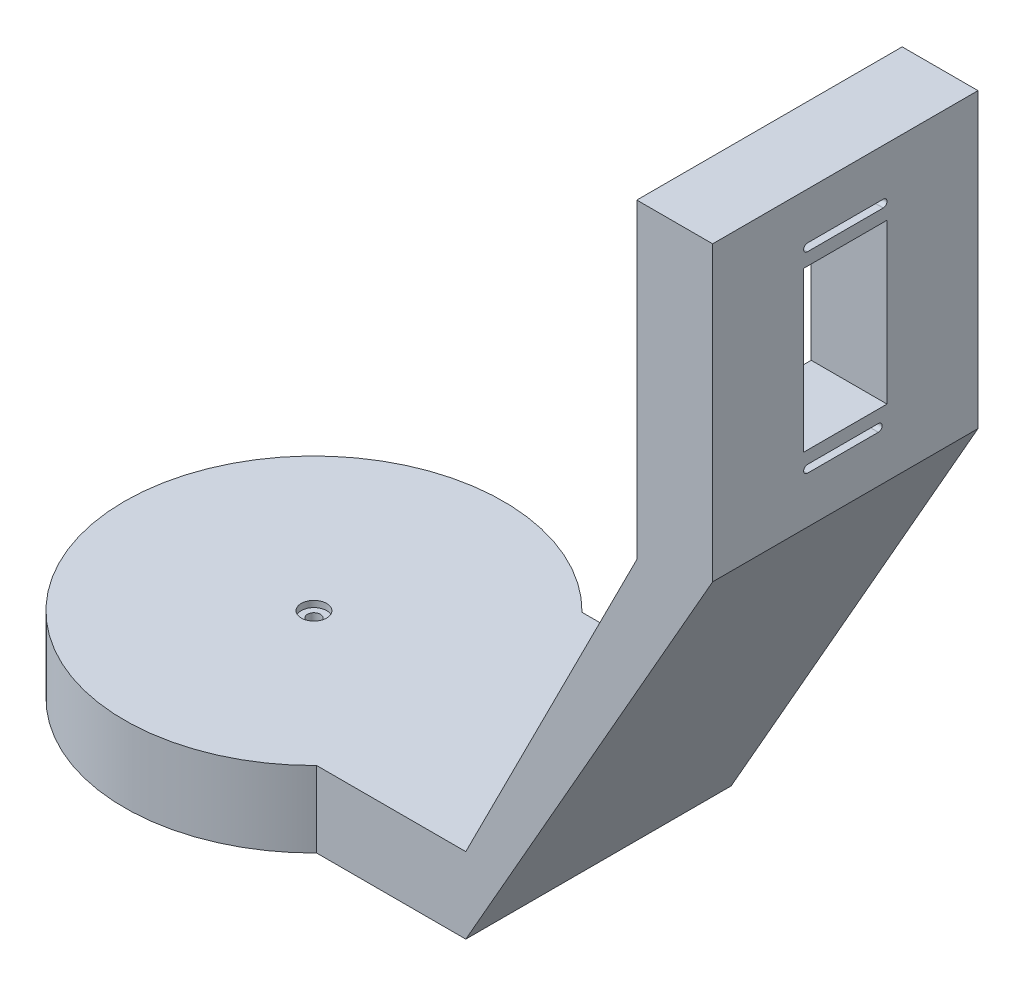
ISO-10303-21;
HEADER;
FILE_DESCRIPTION(('STEP AP214'),'2;1');
FILE_NAME('part.step','',(''),(''),'','','');
FILE_SCHEMA(('AUTOMOTIVE_DESIGN { 1 0 10303 214 1 1 1 1 }'));
ENDSEC;
DATA;
#1=APPLICATION_CONTEXT('core data for automotive mechanical design processes');
#2=APPLICATION_PROTOCOL_DEFINITION('international standard','automotive_design',2000,#1);
#3=PRODUCT_CONTEXT('',#1,'mechanical');
#4=PRODUCT('Part','Part','',(#3));
#5=PRODUCT_RELATED_PRODUCT_CATEGORY('part','',(#4));
#6=PRODUCT_DEFINITION_FORMATION('','',#4);
#7=PRODUCT_DEFINITION_CONTEXT('part definition',#1,'design');
#8=PRODUCT_DEFINITION('design','',#6,#7);
#9=PRODUCT_DEFINITION_SHAPE('','',#8);
#10=(LENGTH_UNIT() NAMED_UNIT(*) SI_UNIT(.MILLI.,.METRE.));
#11=(NAMED_UNIT(*) PLANE_ANGLE_UNIT() SI_UNIT($,.RADIAN.));
#12=(NAMED_UNIT(*) SI_UNIT($,.STERADIAN.) SOLID_ANGLE_UNIT());
#13=UNCERTAINTY_MEASURE_WITH_UNIT(LENGTH_MEASURE(1.E-05),#10,'distance_accuracy_value','');
#14=(GEOMETRIC_REPRESENTATION_CONTEXT(3) GLOBAL_UNCERTAINTY_ASSIGNED_CONTEXT((#13)) GLOBAL_UNIT_ASSIGNED_CONTEXT((#10,
#11,#12)) REPRESENTATION_CONTEXT('',''));
#15=CARTESIAN_POINT('',(0.,0.,0.));
#16=DIRECTION('',(0.,0.,1.));
#17=DIRECTION('',(1.,0.,0.));
#18=AXIS2_PLACEMENT_3D('',#15,#16,#17);
#19=CARTESIAN_POINT('',(0.,20.,0.));
#20=DIRECTION('',(0.,1.,0.));
#21=DIRECTION('',(0.,0.,1.));
#22=AXIS2_PLACEMENT_3D('',#19,#20,#21);
#23=CYLINDRICAL_SURFACE('',#22,1.7);
#24=CARTESIAN_POINT('',(0.,18.35,0.));
#25=DIRECTION('',(0.,1.,0.));
#26=DIRECTION('',(0.,0.,1.));
#27=AXIS2_PLACEMENT_3D('',#24,#25,#26);
#28=CIRCLE('',#27,1.7);
#29=CARTESIAN_POINT('',(0.,18.35,1.7));
#30=VERTEX_POINT('',#29);
#31=EDGE_CURVE('E448',#30,#30,#28,.T.);
#32=ORIENTED_EDGE('',*,*,#31,.T.);
#33=EDGE_LOOP('',(#32));
#34=FACE_BOUND('',#33,.T.);
#35=CARTESIAN_POINT('',(0.,3.5,0.));
#36=DIRECTION('',(0.,-1.,0.));
#37=DIRECTION('',(0.,0.,-1.));
#38=AXIS2_PLACEMENT_3D('',#35,#36,#37);
#39=CIRCLE('',#38,1.7);
#40=CARTESIAN_POINT('',(0.,3.5,-1.7));
#41=VERTEX_POINT('',#40);
#42=EDGE_CURVE('E45',#41,#41,#39,.F.);
#43=ORIENTED_EDGE('',*,*,#42,.F.);
#44=EDGE_LOOP('',(#43));
#45=FACE_BOUND('',#44,.T.);
#46=ADVANCED_FACE('F41',(#34,#45),#23,.F.);
#47=CARTESIAN_POINT('',(30.,2.,-0.0220346998523853));
#48=DIRECTION('',(0.,-1.,0.));
#49=DIRECTION('',(0.,0.,-1.));
#50=AXIS2_PLACEMENT_3D('',#47,#48,#49);
#51=PLANE('',#50);
#52=DIRECTION('',(0.,0.,1.));
#53=VECTOR('',#52,1.);
#54=CARTESIAN_POINT('',(10.446834113617,2.,-0.0220346998523853));
#55=LINE('',#54,#53);
#56=CARTESIAN_POINT('',(10.446834113617,2.,-4.95844978584569));
#57=VERTEX_POINT('',#56);
#58=CARTESIAN_POINT('',(10.446834113617,2.,4.94470051522393));
#59=VERTEX_POINT('',#58);
#60=EDGE_CURVE('E289',#57,#59,#55,.T.);
#61=ORIENTED_EDGE('',*,*,#60,.F.);
#62=DIRECTION('',(-0.995066694728679,0.,-0.0992082307157115));
#63=VECTOR('',#62,1.);
#64=CARTESIAN_POINT('',(29.889613094827,2.,-3.02000313383669));
#65=LINE('',#64,#63);
#66=CARTESIAN_POINT('',(29.889613094827,2.,-3.02000313383669));
#67=VERTEX_POINT('',#66);
#68=EDGE_CURVE('E323',#67,#57,#65,.T.);
#69=ORIENTED_EDGE('',*,*,#68,.F.);
#70=CARTESIAN_POINT('',(30.,2.,-0.0220346998523853));
#71=DIRECTION('',(0.,-1.,0.));
#72=DIRECTION('',(0.,0.,-1.));
#73=AXIS2_PLACEMENT_3D('',#70,#71,#72);
#74=CIRCLE('',#73,3.);
#75=CARTESIAN_POINT('',(29.9254967375497,2.,2.97704003477566));
#76=VERTEX_POINT('',#75);
#77=EDGE_CURVE('E304',#67,#76,#74,.T.);
#78=ORIENTED_EDGE('',*,*,#77,.T.);
#79=DIRECTION('',(-0.994936582249236,0.,0.100504712835816));
#80=VECTOR('',#79,1.);
#81=CARTESIAN_POINT('',(29.9254967375497,2.,2.97704003477566));
#82=LINE('',#81,#80);
#83=EDGE_CURVE('E308',#76,#59,#82,.T.);
#84=ORIENTED_EDGE('',*,*,#83,.T.);
#85=EDGE_LOOP('',(#61,#69,#78,#84));
#86=FACE_BOUND('',#85,.T.);
#87=ADVANCED_FACE('F648',(#86),#51,.T.);
#88=CARTESIAN_POINT('',(0.,20.,0.));
#89=DIRECTION('',(0.,-1.,0.));
#90=DIRECTION('',(0.,0.,-1.));
#91=AXIS2_PLACEMENT_3D('',#88,#89,#90);
#92=CYLINDRICAL_SURFACE('',#91,50.);
#93=CARTESIAN_POINT('',(0.,0.,0.));
#94=DIRECTION('',(0.,1.,0.));
#95=DIRECTION('',(0.,0.,1.));
#96=AXIS2_PLACEMENT_3D('',#93,#94,#95);
#97=CIRCLE('',#96,50.);
#98=CARTESIAN_POINT('',(35.7071421427143,0.,-35.));
#99=VERTEX_POINT('',#98);
#100=CARTESIAN_POINT('',(35.7071421427143,0.,35.));
#101=VERTEX_POINT('',#100);
#102=EDGE_CURVE('E496',#99,#101,#97,.T.);
#103=ORIENTED_EDGE('',*,*,#102,.T.);
#104=DIRECTION('',(0.,-1.,0.));
#105=VECTOR('',#104,1.);
#106=CARTESIAN_POINT('',(35.7071421427143,20.,35.));
#107=LINE('',#106,#105);
#108=CARTESIAN_POINT('',(35.7071421427143,20.,35.));
#109=VERTEX_POINT('',#108);
#110=EDGE_CURVE('E536',#109,#101,#107,.T.);
#111=ORIENTED_EDGE('',*,*,#110,.F.);
#112=CARTESIAN_POINT('',(0.,20.,0.));
#113=DIRECTION('',(0.,1.,0.));
#114=DIRECTION('',(0.,0.,1.));
#115=AXIS2_PLACEMENT_3D('',#112,#113,#114);
#116=CIRCLE('',#115,50.);
#117=CARTESIAN_POINT('',(35.7071421427143,20.,-35.));
#118=VERTEX_POINT('',#117);
#119=EDGE_CURVE('E505',#118,#109,#116,.T.);
#120=ORIENTED_EDGE('',*,*,#119,.F.);
#121=DIRECTION('',(0.,-1.,0.));
#122=VECTOR('',#121,1.);
#123=CARTESIAN_POINT('',(35.7071421427143,20.,-35.));
#124=LINE('',#123,#122);
#125=EDGE_CURVE('E521',#118,#99,#124,.T.);
#126=ORIENTED_EDGE('',*,*,#125,.T.);
#127=EDGE_LOOP('',(#103,#111,#120,#126));
#128=FACE_BOUND('',#127,.T.);
#129=ADVANCED_FACE('F43',(#128),#92,.T.);
#130=CARTESIAN_POINT('',(0.,20.,35.));
#131=DIRECTION('',(0.,0.,-1.));
#132=DIRECTION('',(-1.,0.,0.));
#133=AXIS2_PLACEMENT_3D('',#130,#131,#132);
#134=PLANE('',#133);
#135=DIRECTION('',(1.,0.,0.));
#136=VECTOR('',#135,1.);
#137=CARTESIAN_POINT('',(0.,0.,35.));
#138=LINE('',#137,#136);
#139=CARTESIAN_POINT('',(75.0554768047186,0.,35.));
#140=VERTEX_POINT('',#139);
#141=EDGE_CURVE('E525',#101,#140,#138,.T.);
#142=ORIENTED_EDGE('',*,*,#141,.T.);
#143=DIRECTION('',(0.495370386359118,0.868681863698338,0.));
#144=VECTOR('',#143,1.);
#145=CARTESIAN_POINT('',(75.0554768047186,0.,35.));
#146=LINE('',#145,#144);
#147=CARTESIAN_POINT('',(140.174133176639,114.192122372215,35.));
#148=VERTEX_POINT('',#147);
#149=EDGE_CURVE('E458',#140,#148,#146,.T.);
#150=ORIENTED_EDGE('',*,*,#149,.T.);
#151=DIRECTION('',(0.,1.,0.));
#152=VECTOR('',#151,1.);
#153=CARTESIAN_POINT('',(140.174133176639,114.192122372215,35.));
#154=LINE('',#153,#152);
#155=CARTESIAN_POINT('',(140.174133176639,191.411564080646,35.));
#156=VERTEX_POINT('',#155);
#157=EDGE_CURVE('E452',#148,#156,#154,.T.);
#158=ORIENTED_EDGE('',*,*,#157,.T.);
#159=DIRECTION('',(-1.,0.,0.));
#160=VECTOR('',#159,1.);
#161=CARTESIAN_POINT('',(140.174133176639,191.411564080646,35.));
#162=LINE('',#161,#160);
#163=CARTESIAN_POINT('',(120.174133176639,191.411564080646,35.));
#164=VERTEX_POINT('',#163);
#165=EDGE_CURVE('E478',#156,#164,#162,.T.);
#166=ORIENTED_EDGE('',*,*,#165,.T.);
#167=DIRECTION('',(0.,-1.,0.));
#168=VECTOR('',#167,1.);
#169=CARTESIAN_POINT('',(120.174133176639,191.411564080646,35.));
#170=LINE('',#169,#168);
#171=CARTESIAN_POINT('',(120.174133176639,109.286292207177,35.));
#172=VERTEX_POINT('',#171);
#173=EDGE_CURVE('E482',#164,#172,#170,.T.);
#174=ORIENTED_EDGE('',*,*,#173,.T.);
#175=DIRECTION('',(-0.451012165575392,-0.892517801784925,0.));
#176=VECTOR('',#175,1.);
#177=CARTESIAN_POINT('',(120.174133176639,109.286292207177,35.));
#178=LINE('',#177,#176);
#179=CARTESIAN_POINT('',(75.0554768047186,20.,35.));
#180=VERTEX_POINT('',#179);
#181=EDGE_CURVE('E486',#172,#180,#178,.T.);
#182=ORIENTED_EDGE('',*,*,#181,.T.);
#183=DIRECTION('',(1.,0.,0.));
#184=VECTOR('',#183,1.);
#185=CARTESIAN_POINT('',(0.,20.,35.));
#186=LINE('',#185,#184);
#187=EDGE_CURVE('E509',#109,#180,#186,.T.);
#188=ORIENTED_EDGE('',*,*,#187,.F.);
#189=ORIENTED_EDGE('',*,*,#110,.T.);
#190=EDGE_LOOP('',(#142,#150,#158,#166,#174,#182,#188,#189));
#191=FACE_BOUND('',#190,.T.);
#192=ADVANCED_FACE('F613',(#191),#134,.F.);
#193=CARTESIAN_POINT('',(0.,20.,-35.));
#194=DIRECTION('',(0.,0.,-1.));
#195=DIRECTION('',(-1.,0.,0.));
#196=AXIS2_PLACEMENT_3D('',#193,#194,#195);
#197=PLANE('',#196);
#198=DIRECTION('',(1.,0.,0.));
#199=VECTOR('',#198,1.);
#200=CARTESIAN_POINT('',(0.,0.,-35.));
#201=LINE('',#200,#199);
#202=CARTESIAN_POINT('',(75.0554768047186,0.,-35.));
#203=VERTEX_POINT('',#202);
#204=EDGE_CURVE('E510',#99,#203,#201,.T.);
#205=ORIENTED_EDGE('',*,*,#204,.F.);
#206=ORIENTED_EDGE('',*,*,#125,.F.);
#207=DIRECTION('',(1.,0.,0.));
#208=VECTOR('',#207,1.);
#209=CARTESIAN_POINT('',(0.,20.,-35.));
#210=LINE('',#209,#208);
#211=CARTESIAN_POINT('',(75.0554768047186,20.,-35.));
#212=VERTEX_POINT('',#211);
#213=EDGE_CURVE('E517',#118,#212,#210,.T.);
#214=ORIENTED_EDGE('',*,*,#213,.T.);
#215=DIRECTION('',(-0.451012165575392,-0.892517801784925,0.));
#216=VECTOR('',#215,1.);
#217=CARTESIAN_POINT('',(120.174133176639,109.286292207177,-35.));
#218=LINE('',#217,#216);
#219=CARTESIAN_POINT('',(120.174133176639,109.286292207177,-35.));
#220=VERTEX_POINT('',#219);
#221=EDGE_CURVE('E466',#220,#212,#218,.T.);
#222=ORIENTED_EDGE('',*,*,#221,.F.);
#223=DIRECTION('',(0.,-1.,0.));
#224=VECTOR('',#223,1.);
#225=CARTESIAN_POINT('',(120.174133176639,191.411564080646,-35.));
#226=LINE('',#225,#224);
#227=CARTESIAN_POINT('',(120.174133176639,191.411564080646,-35.));
#228=VERTEX_POINT('',#227);
#229=EDGE_CURVE('E462',#228,#220,#226,.T.);
#230=ORIENTED_EDGE('',*,*,#229,.F.);
#231=DIRECTION('',(-1.,0.,0.));
#232=VECTOR('',#231,1.);
#233=CARTESIAN_POINT('',(140.174133176639,191.411564080646,-35.));
#234=LINE('',#233,#232);
#235=CARTESIAN_POINT('',(140.174133176639,191.411564080646,-35.));
#236=VERTEX_POINT('',#235);
#237=EDGE_CURVE('E457',#236,#228,#234,.T.);
#238=ORIENTED_EDGE('',*,*,#237,.F.);
#239=DIRECTION('',(0.,1.,0.));
#240=VECTOR('',#239,1.);
#241=CARTESIAN_POINT('',(140.174133176639,114.192122372215,-35.));
#242=LINE('',#241,#240);
#243=CARTESIAN_POINT('',(140.174133176639,114.192122372215,-35.));
#244=VERTEX_POINT('',#243);
#245=EDGE_CURVE('E453',#244,#236,#242,.T.);
#246=ORIENTED_EDGE('',*,*,#245,.F.);
#247=DIRECTION('',(0.495370386359118,0.868681863698338,0.));
#248=VECTOR('',#247,1.);
#249=CARTESIAN_POINT('',(75.0554768047186,0.,-35.));
#250=LINE('',#249,#248);
#251=EDGE_CURVE('E470',#203,#244,#250,.T.);
#252=ORIENTED_EDGE('',*,*,#251,.F.);
#253=EDGE_LOOP('',(#205,#206,#214,#222,#230,#238,#246,#252));
#254=FACE_BOUND('',#253,.T.);
#255=ADVANCED_FACE('F619',(#254),#197,.T.);
#256=CARTESIAN_POINT('',(0.,20.,0.));
#257=DIRECTION('',(0.,1.,0.));
#258=DIRECTION('',(0.,0.,1.));
#259=AXIS2_PLACEMENT_3D('',#256,#257,#258);
#260=PLANE('',#259);
#261=CARTESIAN_POINT('',(0.,20.,0.));
#262=DIRECTION('',(0.,1.,0.));
#263=DIRECTION('',(0.,0.,1.));
#264=AXIS2_PLACEMENT_3D('',#261,#262,#263);
#265=CIRCLE('',#264,3.35);
#266=CARTESIAN_POINT('',(0.,20.,3.35));
#267=VERTEX_POINT('',#266);
#268=EDGE_CURVE('E431',#267,#267,#265,.T.);
#269=ORIENTED_EDGE('',*,*,#268,.F.);
#270=EDGE_LOOP('',(#269));
#271=FACE_BOUND('',#270,.T.);
#272=ORIENTED_EDGE('',*,*,#119,.T.);
#273=ORIENTED_EDGE('',*,*,#187,.T.);
#274=DIRECTION('',(0.,0.,1.));
#275=VECTOR('',#274,1.);
#276=CARTESIAN_POINT('',(75.0554768047186,20.,0.));
#277=LINE('',#276,#275);
#278=EDGE_CURVE('E513',#212,#180,#277,.T.);
#279=ORIENTED_EDGE('',*,*,#278,.F.);
#280=ORIENTED_EDGE('',*,*,#213,.F.);
#281=EDGE_LOOP('',(#272,#273,#279,#280));
#282=FACE_BOUND('',#281,.T.);
#283=ADVANCED_FACE('F632',(#271,#282),#260,.T.);
#284=CARTESIAN_POINT('',(0.,0.,0.));
#285=DIRECTION('',(0.,1.,0.));
#286=DIRECTION('',(0.,0.,1.));
#287=AXIS2_PLACEMENT_3D('',#284,#285,#286);
#288=PLANE('',#287);
#289=DIRECTION('',(-0.994936582249236,0.,0.100504712835816));
#290=VECTOR('',#289,1.);
#291=CARTESIAN_POINT('',(29.9254967375497,0.,2.97704003477566));
#292=LINE('',#291,#290);
#293=CARTESIAN_POINT('',(29.9254967375497,0.,2.97704003477566));
#294=VERTEX_POINT('',#293);
#295=CARTESIAN_POINT('',(0.,0.,6.));
#296=VERTEX_POINT('',#295);
#297=EDGE_CURVE('E249',#294,#296,#292,.T.);
#298=ORIENTED_EDGE('',*,*,#297,.F.);
#299=CARTESIAN_POINT('',(30.,0.,-0.0220346998523853));
#300=DIRECTION('',(0.,-1.,0.));
#301=DIRECTION('',(0.,0.,-1.));
#302=AXIS2_PLACEMENT_3D('',#299,#300,#301);
#303=CIRCLE('',#302,3.);
#304=CARTESIAN_POINT('',(29.889613094827,0.,-3.02000313383669));
#305=VERTEX_POINT('',#304);
#306=EDGE_CURVE('E58',#305,#294,#303,.T.);
#307=ORIENTED_EDGE('',*,*,#306,.F.);
#308=DIRECTION('',(-0.995066694728679,0.,-0.0992082307157115));
#309=VECTOR('',#308,1.);
#310=CARTESIAN_POINT('',(29.889613094827,0.,-3.02000313383669));
#311=LINE('',#310,#309);
#312=CARTESIAN_POINT('',(0.,0.,-6.));
#313=VERTEX_POINT('',#312);
#314=EDGE_CURVE('E309',#305,#313,#311,.T.);
#315=ORIENTED_EDGE('',*,*,#314,.T.);
#316=DIRECTION('',(0.998337055490868,0.,-0.0576465405191379));
#317=VECTOR('',#316,1.);
#318=CARTESIAN_POINT('',(-30.0737171703665,0.,-4.26346648570486));
#319=LINE('',#318,#317);
#320=CARTESIAN_POINT('',(-30.0737171703665,0.,-4.26346648570486));
#321=VERTEX_POINT('',#320);
#322=EDGE_CURVE('E338',#321,#313,#319,.T.);
#323=ORIENTED_EDGE('',*,*,#322,.F.);
#324=CARTESIAN_POINT('',(-30.,0.,-0.640077242931038));
#325=DIRECTION('',(0.,1.,0.));
#326=DIRECTION('',(0.,0.,1.));
#327=AXIS2_PLACEMENT_3D('',#324,#325,#326);
#328=CIRCLE('',#327,3.6241390461537);
#329=CARTESIAN_POINT('',(-29.9389781936391,0.,2.98354803639964));
#330=VERTEX_POINT('',#329);
#331=EDGE_CURVE('E334',#321,#330,#328,.T.);
#332=ORIENTED_EDGE('',*,*,#331,.T.);
#333=DIRECTION('',(0.994962701350082,0.,0.100245812491832));
#334=VECTOR('',#333,1.);
#335=CARTESIAN_POINT('',(-29.9389781936391,0.,2.98354803639964));
#336=LINE('',#335,#334);
#337=EDGE_CURVE('E331',#330,#296,#336,.T.);
#338=ORIENTED_EDGE('',*,*,#337,.T.);
#339=EDGE_LOOP('',(#298,#307,#315,#323,#332,#338));
#340=FACE_BOUND('',#339,.T.);
#341=ORIENTED_EDGE('',*,*,#102,.F.);
#342=ORIENTED_EDGE('',*,*,#204,.T.);
#343=DIRECTION('',(0.,0.,1.));
#344=VECTOR('',#343,1.);
#345=CARTESIAN_POINT('',(75.0554768047186,0.,0.));
#346=LINE('',#345,#344);
#347=EDGE_CURVE('E529',#203,#140,#346,.T.);
#348=ORIENTED_EDGE('',*,*,#347,.T.);
#349=ORIENTED_EDGE('',*,*,#141,.F.);
#350=EDGE_LOOP('',(#341,#342,#348,#349));
#351=FACE_BOUND('',#350,.T.);
#352=ADVANCED_FACE('F598',(#340,#351),#288,.F.);
#353=CARTESIAN_POINT('',(140.174133176639,114.192122372215,-35.));
#354=DIRECTION('',(1.,0.,0.));
#355=DIRECTION('',(0.,0.,-1.));
#356=AXIS2_PLACEMENT_3D('',#353,#354,#355);
#357=PLANE('',#356);
#358=CARTESIAN_POINT('',(140.174133176639,178.101564080646,10.));
#359=DIRECTION('',(1.,0.,0.));
#360=DIRECTION('',(0.,0.,-1.));
#361=AXIS2_PLACEMENT_3D('',#358,#359,#360);
#362=CIRCLE('',#361,1.);
#363=CARTESIAN_POINT('',(140.174133176639,179.101564080646,10.));
#364=VERTEX_POINT('',#363);
#365=CARTESIAN_POINT('',(140.174133176639,177.101564080646,10.));
#366=VERTEX_POINT('',#365);
#367=EDGE_CURVE('E66',#364,#366,#362,.T.);
#368=ORIENTED_EDGE('',*,*,#367,.F.);
#369=DIRECTION('',(0.,0.,1.));
#370=VECTOR('',#369,1.);
#371=CARTESIAN_POINT('',(140.174133176639,179.101564080646,10.));
#372=LINE('',#371,#370);
#373=CARTESIAN_POINT('',(140.174133176639,179.101564080646,-10.));
#374=VERTEX_POINT('',#373);
#375=EDGE_CURVE('E370',#374,#364,#372,.T.);
#376=ORIENTED_EDGE('',*,*,#375,.F.);
#377=CARTESIAN_POINT('',(140.174133176639,178.101564080646,-10.));
#378=DIRECTION('',(1.,0.,0.));
#379=DIRECTION('',(0.,0.,1.));
#380=AXIS2_PLACEMENT_3D('',#377,#378,#379);
#381=CIRCLE('',#380,1.);
#382=CARTESIAN_POINT('',(140.174133176639,177.101564080646,-10.));
#383=VERTEX_POINT('',#382);
#384=EDGE_CURVE('E366',#383,#374,#381,.T.);
#385=ORIENTED_EDGE('',*,*,#384,.F.);
#386=DIRECTION('',(0.,0.,-1.));
#387=VECTOR('',#386,1.);
#388=CARTESIAN_POINT('',(140.174133176639,177.101564080646,10.));
#389=LINE('',#388,#387);
#390=EDGE_CURVE('E361',#366,#383,#389,.T.);
#391=ORIENTED_EDGE('',*,*,#390,.F.);
#392=EDGE_LOOP('',(#368,#376,#385,#391));
#393=FACE_BOUND('',#392,.T.);
#394=CARTESIAN_POINT('',(140.174133176639,127.501564080646,10.));
#395=DIRECTION('',(1.,0.,0.));
#396=DIRECTION('',(0.,0.,-1.));
#397=AXIS2_PLACEMENT_3D('',#394,#395,#396);
#398=CIRCLE('',#397,1.);
#399=CARTESIAN_POINT('',(140.174133176639,128.501564080646,10.));
#400=VERTEX_POINT('',#399);
#401=CARTESIAN_POINT('',(140.174133176639,126.501564080646,10.));
#402=VERTEX_POINT('',#401);
#403=EDGE_CURVE('E347',#400,#402,#398,.T.);
#404=ORIENTED_EDGE('',*,*,#403,.F.);
#405=DIRECTION('',(0.,0.,1.));
#406=VECTOR('',#405,1.);
#407=CARTESIAN_POINT('',(140.174133176639,128.501564080646,10.));
#408=LINE('',#407,#406);
#409=CARTESIAN_POINT('',(140.174133176639,128.501564080646,-8.70627595615708));
#410=VERTEX_POINT('',#409);
#411=EDGE_CURVE('E397',#410,#400,#408,.T.);
#412=ORIENTED_EDGE('',*,*,#411,.F.);
#413=CARTESIAN_POINT('',(140.174133176639,127.501564080646,-8.70627595615708));
#414=DIRECTION('',(1.,0.,0.));
#415=DIRECTION('',(0.,0.,1.));
#416=AXIS2_PLACEMENT_3D('',#413,#414,#415);
#417=CIRCLE('',#416,1.00000000000003);
#418=CARTESIAN_POINT('',(140.174133176639,126.501564080646,-8.70627595615708));
#419=VERTEX_POINT('',#418);
#420=EDGE_CURVE('E393',#419,#410,#417,.T.);
#421=ORIENTED_EDGE('',*,*,#420,.F.);
#422=DIRECTION('',(0.,0.,-1.));
#423=VECTOR('',#422,1.);
#424=CARTESIAN_POINT('',(140.174133176639,126.501564080646,10.));
#425=LINE('',#424,#423);
#426=EDGE_CURVE('E389',#402,#419,#425,.T.);
#427=ORIENTED_EDGE('',*,*,#426,.F.);
#428=EDGE_LOOP('',(#404,#412,#421,#427));
#429=FACE_BOUND('',#428,.T.);
#430=DIRECTION('',(0.,-1.,0.));
#431=VECTOR('',#430,1.);
#432=CARTESIAN_POINT('',(140.174133176639,173.801564080646,11.));
#433=LINE('',#432,#431);
#434=CARTESIAN_POINT('',(140.174133176639,173.801564080646,11.));
#435=VERTEX_POINT('',#434);
#436=CARTESIAN_POINT('',(140.174133176639,131.801564080646,11.));
#437=VERTEX_POINT('',#436);
#438=EDGE_CURVE('E378',#435,#437,#433,.T.);
#439=ORIENTED_EDGE('',*,*,#438,.F.);
#440=DIRECTION('',(0.,0.,1.));
#441=VECTOR('',#440,1.);
#442=CARTESIAN_POINT('',(140.174133176639,173.801564080646,11.));
#443=LINE('',#442,#441);
#444=CARTESIAN_POINT('',(140.174133176639,173.801564080646,-11.));
#445=VERTEX_POINT('',#444);
#446=EDGE_CURVE('E423',#445,#435,#443,.T.);
#447=ORIENTED_EDGE('',*,*,#446,.F.);
#448=DIRECTION('',(0.,1.,0.));
#449=VECTOR('',#448,1.);
#450=CARTESIAN_POINT('',(140.174133176639,173.801564080646,-11.));
#451=LINE('',#450,#449);
#452=CARTESIAN_POINT('',(140.174133176639,131.801564080646,-11.));
#453=VERTEX_POINT('',#452);
#454=EDGE_CURVE('E419',#453,#445,#451,.T.);
#455=ORIENTED_EDGE('',*,*,#454,.F.);
#456=DIRECTION('',(0.,0.,-1.));
#457=VECTOR('',#456,1.);
#458=CARTESIAN_POINT('',(140.174133176639,131.801564080646,11.));
#459=LINE('',#458,#457);
#460=EDGE_CURVE('E415',#437,#453,#459,.T.);
#461=ORIENTED_EDGE('',*,*,#460,.F.);
#462=EDGE_LOOP('',(#439,#447,#455,#461));
#463=FACE_BOUND('',#462,.T.);
#464=ORIENTED_EDGE('',*,*,#157,.F.);
#465=DIRECTION('',(0.,0.,1.));
#466=VECTOR('',#465,1.);
#467=CARTESIAN_POINT('',(140.174133176639,114.192122372215,-35.));
#468=LINE('',#467,#466);
#469=EDGE_CURVE('E493',#244,#148,#468,.T.);
#470=ORIENTED_EDGE('',*,*,#469,.F.);
#471=ORIENTED_EDGE('',*,*,#245,.T.);
#472=DIRECTION('',(0.,0.,1.));
#473=VECTOR('',#472,1.);
#474=CARTESIAN_POINT('',(140.174133176639,191.411564080646,-35.));
#475=LINE('',#474,#473);
#476=EDGE_CURVE('E474',#236,#156,#475,.T.);
#477=ORIENTED_EDGE('',*,*,#476,.T.);
#478=EDGE_LOOP('',(#464,#470,#471,#477));
#479=FACE_BOUND('',#478,.T.);
#480=ADVANCED_FACE('F594',(#393,#429,#463,#479),#357,.T.);
#481=CARTESIAN_POINT('',(75.0554768047186,0.,-35.));
#482=DIRECTION('',(0.868681863698338,-0.495370386359118,0.));
#483=DIRECTION('',(0.495370386359118,0.868681863698338,0.));
#484=AXIS2_PLACEMENT_3D('',#481,#482,#483);
#485=PLANE('',#484);
#486=ORIENTED_EDGE('',*,*,#149,.F.);
#487=ORIENTED_EDGE('',*,*,#347,.F.);
#488=ORIENTED_EDGE('',*,*,#251,.T.);
#489=ORIENTED_EDGE('',*,*,#469,.T.);
#490=EDGE_LOOP('',(#486,#487,#488,#489));
#491=FACE_BOUND('',#490,.T.);
#492=ADVANCED_FACE('F597',(#491),#485,.T.);
#493=CARTESIAN_POINT('',(120.174133176639,109.286292207177,-35.));
#494=DIRECTION('',(-0.892517801784925,0.451012165575392,0.));
#495=DIRECTION('',(-0.451012165575392,-0.892517801784925,0.));
#496=AXIS2_PLACEMENT_3D('',#493,#494,#495);
#497=PLANE('',#496);
#498=ORIENTED_EDGE('',*,*,#181,.F.);
#499=DIRECTION('',(0.,0.,1.));
#500=VECTOR('',#499,1.);
#501=CARTESIAN_POINT('',(120.174133176639,109.286292207177,-35.));
#502=LINE('',#501,#500);
#503=EDGE_CURVE('E497',#220,#172,#502,.T.);
#504=ORIENTED_EDGE('',*,*,#503,.F.);
#505=ORIENTED_EDGE('',*,*,#221,.T.);
#506=ORIENTED_EDGE('',*,*,#278,.T.);
#507=EDGE_LOOP('',(#498,#504,#505,#506));
#508=FACE_BOUND('',#507,.T.);
#509=ADVANCED_FACE('F629',(#508),#497,.T.);
#510=CARTESIAN_POINT('',(120.174133176639,191.411564080646,-35.));
#511=DIRECTION('',(-1.,0.,0.));
#512=DIRECTION('',(0.,0.,1.));
#513=AXIS2_PLACEMENT_3D('',#510,#511,#512);
#514=PLANE('',#513);
#515=CARTESIAN_POINT('',(120.174133176639,178.101564080646,10.));
#516=DIRECTION('',(-1.,0.,0.));
#517=DIRECTION('',(0.,0.,1.));
#518=AXIS2_PLACEMENT_3D('',#515,#516,#517);
#519=CIRCLE('',#518,1.);
#520=CARTESIAN_POINT('',(120.174133176639,177.101564080646,10.));
#521=VERTEX_POINT('',#520);
#522=CARTESIAN_POINT('',(120.174133176639,179.101564080646,10.));
#523=VERTEX_POINT('',#522);
#524=EDGE_CURVE('E11',#521,#523,#519,.T.);
#525=ORIENTED_EDGE('',*,*,#524,.F.);
#526=DIRECTION('',(0.,0.,1.));
#527=VECTOR('',#526,1.);
#528=CARTESIAN_POINT('',(120.174133176639,177.101564080646,-35.));
#529=LINE('',#528,#527);
#530=CARTESIAN_POINT('',(120.174133176639,177.101564080646,-9.99999999999999));
#531=VERTEX_POINT('',#530);
#532=EDGE_CURVE('E566',#531,#521,#529,.T.);
#533=ORIENTED_EDGE('',*,*,#532,.F.);
#534=CARTESIAN_POINT('',(120.174133176639,178.101564080646,-10.));
#535=DIRECTION('',(-1.,0.,0.));
#536=DIRECTION('',(0.,0.,1.));
#537=AXIS2_PLACEMENT_3D('',#534,#535,#536);
#538=CIRCLE('',#537,1.);
#539=CARTESIAN_POINT('',(120.174133176639,179.101564080646,-10.));
#540=VERTEX_POINT('',#539);
#541=EDGE_CURVE('E569',#540,#531,#538,.T.);
#542=ORIENTED_EDGE('',*,*,#541,.F.);
#543=DIRECTION('',(0.,0.,-1.));
#544=VECTOR('',#543,1.);
#545=CARTESIAN_POINT('',(120.174133176639,179.101564080646,-35.));
#546=LINE('',#545,#544);
#547=EDGE_CURVE('E51',#523,#540,#546,.T.);
#548=ORIENTED_EDGE('',*,*,#547,.F.);
#549=EDGE_LOOP('',(#525,#533,#542,#548));
#550=FACE_BOUND('',#549,.T.);
#551=CARTESIAN_POINT('',(120.174133176639,127.501564080646,10.));
#552=DIRECTION('',(-1.,0.,0.));
#553=DIRECTION('',(0.,0.,1.));
#554=AXIS2_PLACEMENT_3D('',#551,#552,#553);
#555=CIRCLE('',#554,1.);
#556=CARTESIAN_POINT('',(120.174133176639,126.501564080646,10.));
#557=VERTEX_POINT('',#556);
#558=CARTESIAN_POINT('',(120.174133176639,128.501564080646,10.));
#559=VERTEX_POINT('',#558);
#560=EDGE_CURVE('E563',#557,#559,#555,.T.);
#561=ORIENTED_EDGE('',*,*,#560,.F.);
#562=DIRECTION('',(0.,0.,1.));
#563=VECTOR('',#562,1.);
#564=CARTESIAN_POINT('',(120.174133176639,126.501564080646,-34.9999999999999));
#565=LINE('',#564,#563);
#566=CARTESIAN_POINT('',(120.174133176639,126.501564080646,-8.70627595615708));
#567=VERTEX_POINT('',#566);
#568=EDGE_CURVE('E553',#567,#557,#565,.T.);
#569=ORIENTED_EDGE('',*,*,#568,.F.);
#570=CARTESIAN_POINT('',(120.174133176639,127.501564080646,-8.70627595615708));
#571=DIRECTION('',(-1.,0.,0.));
#572=DIRECTION('',(0.,0.,1.));
#573=AXIS2_PLACEMENT_3D('',#570,#571,#572);
#574=CIRCLE('',#573,1.00000000000003);
#575=CARTESIAN_POINT('',(120.174133176639,128.501564080646,-8.70627595615708));
#576=VERTEX_POINT('',#575);
#577=EDGE_CURVE('E556',#576,#567,#574,.T.);
#578=ORIENTED_EDGE('',*,*,#577,.F.);
#579=DIRECTION('',(0.,0.,-1.));
#580=VECTOR('',#579,1.);
#581=CARTESIAN_POINT('',(120.174133176639,128.501564080646,-35.0000000000001));
#582=LINE('',#581,#580);
#583=EDGE_CURVE('E560',#559,#576,#582,.T.);
#584=ORIENTED_EDGE('',*,*,#583,.F.);
#585=EDGE_LOOP('',(#561,#569,#578,#584));
#586=FACE_BOUND('',#585,.T.);
#587=DIRECTION('',(0.,1.,0.));
#588=VECTOR('',#587,1.);
#589=CARTESIAN_POINT('',(120.174133176639,191.411564080646,11.));
#590=LINE('',#589,#588);
#591=CARTESIAN_POINT('',(120.174133176639,131.801564080646,11.));
#592=VERTEX_POINT('',#591);
#593=CARTESIAN_POINT('',(120.174133176639,173.801564080646,11.));
#594=VERTEX_POINT('',#593);
#595=EDGE_CURVE('E550',#592,#594,#590,.T.);
#596=ORIENTED_EDGE('',*,*,#595,.F.);
#597=DIRECTION('',(0.,0.,1.));
#598=VECTOR('',#597,1.);
#599=CARTESIAN_POINT('',(120.174133176639,131.801564080646,-35.));
#600=LINE('',#599,#598);
#601=CARTESIAN_POINT('',(120.174133176639,131.801564080646,-11.));
#602=VERTEX_POINT('',#601);
#603=EDGE_CURVE('E540',#602,#592,#600,.T.);
#604=ORIENTED_EDGE('',*,*,#603,.F.);
#605=DIRECTION('',(0.,-1.,0.));
#606=VECTOR('',#605,1.);
#607=CARTESIAN_POINT('',(120.174133176639,191.411564080646,-11.));
#608=LINE('',#607,#606);
#609=CARTESIAN_POINT('',(120.174133176639,173.801564080646,-11.));
#610=VERTEX_POINT('',#609);
#611=EDGE_CURVE('E543',#610,#602,#608,.T.);
#612=ORIENTED_EDGE('',*,*,#611,.F.);
#613=DIRECTION('',(0.,0.,-1.));
#614=VECTOR('',#613,1.);
#615=CARTESIAN_POINT('',(120.174133176639,173.801564080646,-35.));
#616=LINE('',#615,#614);
#617=EDGE_CURVE('E547',#594,#610,#616,.T.);
#618=ORIENTED_EDGE('',*,*,#617,.F.);
#619=EDGE_LOOP('',(#596,#604,#612,#618));
#620=FACE_BOUND('',#619,.T.);
#621=ORIENTED_EDGE('',*,*,#173,.F.);
#622=DIRECTION('',(0.,0.,1.));
#623=VECTOR('',#622,1.);
#624=CARTESIAN_POINT('',(120.174133176639,191.411564080646,-35.));
#625=LINE('',#624,#623);
#626=EDGE_CURVE('E500',#228,#164,#625,.T.);
#627=ORIENTED_EDGE('',*,*,#626,.F.);
#628=ORIENTED_EDGE('',*,*,#229,.T.);
#629=ORIENTED_EDGE('',*,*,#503,.T.);
#630=EDGE_LOOP('',(#621,#627,#628,#629));
#631=FACE_BOUND('',#630,.T.);
#632=ADVANCED_FACE('F587',(#550,#586,#620,#631),#514,.T.);
#633=CARTESIAN_POINT('',(140.174133176639,191.411564080646,-35.));
#634=DIRECTION('',(0.,1.,0.));
#635=DIRECTION('',(0.,0.,1.));
#636=AXIS2_PLACEMENT_3D('',#633,#634,#635);
#637=PLANE('',#636);
#638=ORIENTED_EDGE('',*,*,#165,.F.);
#639=ORIENTED_EDGE('',*,*,#476,.F.);
#640=ORIENTED_EDGE('',*,*,#237,.T.);
#641=ORIENTED_EDGE('',*,*,#626,.T.);
#642=EDGE_LOOP('',(#638,#639,#640,#641));
#643=FACE_BOUND('',#642,.T.);
#644=ADVANCED_FACE('F624',(#643),#637,.T.);
#645=CARTESIAN_POINT('',(1.7,18.35,0.));
#646=DIRECTION('',(0.,-1.,0.));
#647=DIRECTION('',(0.,0.,-1.));
#648=AXIS2_PLACEMENT_3D('',#645,#646,#647);
#649=PLANE('',#648);
#650=ORIENTED_EDGE('',*,*,#31,.F.);
#651=EDGE_LOOP('',(#650));
#652=FACE_BOUND('',#651,.T.);
#653=CARTESIAN_POINT('',(0.,18.35,0.));
#654=DIRECTION('',(0.,1.,0.));
#655=DIRECTION('',(0.,0.,1.));
#656=AXIS2_PLACEMENT_3D('',#653,#654,#655);
#657=CIRCLE('',#656,3.35);
#658=CARTESIAN_POINT('',(0.,18.35,3.35));
#659=VERTEX_POINT('',#658);
#660=EDGE_CURVE('E444',#659,#659,#657,.T.);
#661=ORIENTED_EDGE('',*,*,#660,.T.);
#662=EDGE_LOOP('',(#661));
#663=FACE_BOUND('',#662,.T.);
#664=ADVANCED_FACE('F660',(#652,#663),#649,.F.);
#665=CARTESIAN_POINT('',(0.,20.,0.));
#666=DIRECTION('',(0.,1.,0.));
#667=DIRECTION('',(0.,0.,1.));
#668=AXIS2_PLACEMENT_3D('',#665,#666,#667);
#669=CYLINDRICAL_SURFACE('',#668,3.35);
#670=ORIENTED_EDGE('',*,*,#660,.F.);
#671=EDGE_LOOP('',(#670));
#672=FACE_BOUND('',#671,.T.);
#673=ORIENTED_EDGE('',*,*,#268,.T.);
#674=EDGE_LOOP('',(#673));
#675=FACE_BOUND('',#674,.T.);
#676=ADVANCED_FACE('F672',(#672,#675),#669,.F.);
#677=CARTESIAN_POINT('',(108.174133176639,173.801564080646,11.));
#678=DIRECTION('',(0.,0.,1.));
#679=DIRECTION('',(0.,-1.,0.));
#680=AXIS2_PLACEMENT_3D('',#677,#678,#679);
#681=PLANE('',#680);
#682=ORIENTED_EDGE('',*,*,#595,.T.);
#683=DIRECTION('',(1.,0.,0.));
#684=VECTOR('',#683,1.);
#685=CARTESIAN_POINT('',(108.174133176639,173.801564080646,11.));
#686=LINE('',#685,#684);
#687=EDGE_CURVE('E428',#594,#435,#686,.T.);
#688=ORIENTED_EDGE('',*,*,#687,.T.);
#689=ORIENTED_EDGE('',*,*,#438,.T.);
#690=DIRECTION('',(1.,0.,0.));
#691=VECTOR('',#690,1.);
#692=CARTESIAN_POINT('',(108.174133176639,131.801564080646,11.));
#693=LINE('',#692,#691);
#694=EDGE_CURVE('E427',#592,#437,#693,.T.);
#695=ORIENTED_EDGE('',*,*,#694,.F.);
#696=EDGE_LOOP('',(#682,#688,#689,#695));
#697=FACE_BOUND('',#696,.T.);
#698=ADVANCED_FACE('F677',(#697),#681,.F.);
#699=CARTESIAN_POINT('',(108.174133176639,173.801564080646,11.));
#700=DIRECTION('',(0.,1.,0.));
#701=DIRECTION('',(0.,0.,1.));
#702=AXIS2_PLACEMENT_3D('',#699,#700,#701);
#703=PLANE('',#702);
#704=ORIENTED_EDGE('',*,*,#617,.T.);
#705=DIRECTION('',(1.,0.,0.));
#706=VECTOR('',#705,1.);
#707=CARTESIAN_POINT('',(108.174133176639,173.801564080646,-11.));
#708=LINE('',#707,#706);
#709=EDGE_CURVE('E432',#610,#445,#708,.T.);
#710=ORIENTED_EDGE('',*,*,#709,.T.);
#711=ORIENTED_EDGE('',*,*,#446,.T.);
#712=ORIENTED_EDGE('',*,*,#687,.F.);
#713=EDGE_LOOP('',(#704,#710,#711,#712));
#714=FACE_BOUND('',#713,.T.);
#715=ADVANCED_FACE('F687',(#714),#703,.F.);
#716=CARTESIAN_POINT('',(108.174133176639,173.801564080646,-11.));
#717=DIRECTION('',(0.,0.,-1.));
#718=DIRECTION('',(0.,1.,0.));
#719=AXIS2_PLACEMENT_3D('',#716,#717,#718);
#720=PLANE('',#719);
#721=ORIENTED_EDGE('',*,*,#611,.T.);
#722=DIRECTION('',(1.,0.,0.));
#723=VECTOR('',#722,1.);
#724=CARTESIAN_POINT('',(108.174133176639,131.801564080646,-11.));
#725=LINE('',#724,#723);
#726=EDGE_CURVE('E435',#602,#453,#725,.T.);
#727=ORIENTED_EDGE('',*,*,#726,.T.);
#728=ORIENTED_EDGE('',*,*,#454,.T.);
#729=ORIENTED_EDGE('',*,*,#709,.F.);
#730=EDGE_LOOP('',(#721,#727,#728,#729));
#731=FACE_BOUND('',#730,.T.);
#732=ADVANCED_FACE('F695',(#731),#720,.F.);
#733=CARTESIAN_POINT('',(108.174133176639,131.801564080646,11.));
#734=DIRECTION('',(0.,-1.,0.));
#735=DIRECTION('',(0.,0.,-1.));
#736=AXIS2_PLACEMENT_3D('',#733,#734,#735);
#737=PLANE('',#736);
#738=ORIENTED_EDGE('',*,*,#603,.T.);
#739=ORIENTED_EDGE('',*,*,#694,.T.);
#740=ORIENTED_EDGE('',*,*,#460,.T.);
#741=ORIENTED_EDGE('',*,*,#726,.F.);
#742=EDGE_LOOP('',(#738,#739,#740,#741));
#743=FACE_BOUND('',#742,.T.);
#744=ADVANCED_FACE('F691',(#743),#737,.F.);
#745=CARTESIAN_POINT('',(73.1741331766393,127.501564080646,10.));
#746=DIRECTION('',(1.,0.,0.));
#747=DIRECTION('',(0.,0.,-1.));
#748=AXIS2_PLACEMENT_3D('',#745,#746,#747);
#749=CYLINDRICAL_SURFACE('',#748,1.);
#750=ORIENTED_EDGE('',*,*,#560,.T.);
#751=DIRECTION('',(1.,0.,0.));
#752=VECTOR('',#751,1.);
#753=CARTESIAN_POINT('',(73.1741331766393,128.501564080646,10.));
#754=LINE('',#753,#752);
#755=EDGE_CURVE('E362',#559,#400,#754,.T.);
#756=ORIENTED_EDGE('',*,*,#755,.T.);
#757=ORIENTED_EDGE('',*,*,#403,.T.);
#758=DIRECTION('',(1.,0.,0.));
#759=VECTOR('',#758,1.);
#760=CARTESIAN_POINT('',(73.1741331766393,126.501564080646,10.));
#761=LINE('',#760,#759);
#762=EDGE_CURVE('E401',#557,#402,#761,.T.);
#763=ORIENTED_EDGE('',*,*,#762,.F.);
#764=EDGE_LOOP('',(#750,#756,#757,#763));
#765=FACE_BOUND('',#764,.T.);
#766=ADVANCED_FACE('F694',(#765),#749,.F.);
#767=CARTESIAN_POINT('',(73.1741331766393,128.501564080646,10.));
#768=DIRECTION('',(0.,1.,0.));
#769=DIRECTION('',(0.,0.,1.));
#770=AXIS2_PLACEMENT_3D('',#767,#768,#769);
#771=PLANE('',#770);
#772=ORIENTED_EDGE('',*,*,#583,.T.);
#773=DIRECTION('',(1.,0.,0.));
#774=VECTOR('',#773,1.);
#775=CARTESIAN_POINT('',(73.1741331766393,128.501564080646,-8.70627595615708));
#776=LINE('',#775,#774);
#777=EDGE_CURVE('E404',#576,#410,#776,.T.);
#778=ORIENTED_EDGE('',*,*,#777,.T.);
#779=ORIENTED_EDGE('',*,*,#411,.T.);
#780=ORIENTED_EDGE('',*,*,#755,.F.);
#781=EDGE_LOOP('',(#772,#778,#779,#780));
#782=FACE_BOUND('',#781,.T.);
#783=ADVANCED_FACE('F705',(#782),#771,.F.);
#784=CARTESIAN_POINT('',(73.1741331766393,127.501564080646,-8.70627595615708));
#785=DIRECTION('',(1.,0.,0.));
#786=DIRECTION('',(0.,0.,-1.));
#787=AXIS2_PLACEMENT_3D('',#784,#785,#786);
#788=CYLINDRICAL_SURFACE('',#787,1.00000000000003);
#789=ORIENTED_EDGE('',*,*,#577,.T.);
#790=DIRECTION('',(1.,0.,0.));
#791=VECTOR('',#790,1.);
#792=CARTESIAN_POINT('',(73.1741331766393,126.501564080646,-8.70627595615708));
#793=LINE('',#792,#791);
#794=EDGE_CURVE('E407',#567,#419,#793,.T.);
#795=ORIENTED_EDGE('',*,*,#794,.T.);
#796=ORIENTED_EDGE('',*,*,#420,.T.);
#797=ORIENTED_EDGE('',*,*,#777,.F.);
#798=EDGE_LOOP('',(#789,#795,#796,#797));
#799=FACE_BOUND('',#798,.T.);
#800=ADVANCED_FACE('F710',(#799),#788,.F.);
#801=CARTESIAN_POINT('',(73.1741331766393,126.501564080646,10.));
#802=DIRECTION('',(0.,-1.,0.));
#803=DIRECTION('',(0.,0.,-1.));
#804=AXIS2_PLACEMENT_3D('',#801,#802,#803);
#805=PLANE('',#804);
#806=ORIENTED_EDGE('',*,*,#568,.T.);
#807=ORIENTED_EDGE('',*,*,#762,.T.);
#808=ORIENTED_EDGE('',*,*,#426,.T.);
#809=ORIENTED_EDGE('',*,*,#794,.F.);
#810=EDGE_LOOP('',(#806,#807,#808,#809));
#811=FACE_BOUND('',#810,.T.);
#812=ADVANCED_FACE('F707',(#811),#805,.F.);
#813=CARTESIAN_POINT('',(73.1741331766393,178.101564080646,10.));
#814=DIRECTION('',(1.,0.,0.));
#815=DIRECTION('',(0.,0.,-1.));
#816=AXIS2_PLACEMENT_3D('',#813,#814,#815);
#817=CYLINDRICAL_SURFACE('',#816,1.);
#818=ORIENTED_EDGE('',*,*,#524,.T.);
#819=DIRECTION('',(1.,0.,0.));
#820=VECTOR('',#819,1.);
#821=CARTESIAN_POINT('',(73.1741331766393,179.101564080646,10.));
#822=LINE('',#821,#820);
#823=EDGE_CURVE('E375',#523,#364,#822,.T.);
#824=ORIENTED_EDGE('',*,*,#823,.T.);
#825=ORIENTED_EDGE('',*,*,#367,.T.);
#826=DIRECTION('',(1.,0.,0.));
#827=VECTOR('',#826,1.);
#828=CARTESIAN_POINT('',(73.1741331766393,177.101564080646,10.));
#829=LINE('',#828,#827);
#830=EDGE_CURVE('E374',#521,#366,#829,.T.);
#831=ORIENTED_EDGE('',*,*,#830,.F.);
#832=EDGE_LOOP('',(#818,#824,#825,#831));
#833=FACE_BOUND('',#832,.T.);
#834=ADVANCED_FACE('F592',(#833),#817,.F.);
#835=CARTESIAN_POINT('',(73.1741331766393,179.101564080646,10.));
#836=DIRECTION('',(0.,1.,0.));
#837=DIRECTION('',(0.,0.,1.));
#838=AXIS2_PLACEMENT_3D('',#835,#836,#837);
#839=PLANE('',#838);
#840=ORIENTED_EDGE('',*,*,#547,.T.);
#841=DIRECTION('',(1.,0.,0.));
#842=VECTOR('',#841,1.);
#843=CARTESIAN_POINT('',(73.1741331766393,179.101564080646,-10.));
#844=LINE('',#843,#842);
#845=EDGE_CURVE('E379',#540,#374,#844,.T.);
#846=ORIENTED_EDGE('',*,*,#845,.T.);
#847=ORIENTED_EDGE('',*,*,#375,.T.);
#848=ORIENTED_EDGE('',*,*,#823,.F.);
#849=EDGE_LOOP('',(#840,#846,#847,#848));
#850=FACE_BOUND('',#849,.T.);
#851=ADVANCED_FACE('F578',(#850),#839,.F.);
#852=CARTESIAN_POINT('',(73.1741331766393,178.101564080646,-10.));
#853=DIRECTION('',(1.,0.,0.));
#854=DIRECTION('',(0.,0.,-1.));
#855=AXIS2_PLACEMENT_3D('',#852,#853,#854);
#856=CYLINDRICAL_SURFACE('',#855,1.);
#857=ORIENTED_EDGE('',*,*,#541,.T.);
#858=DIRECTION('',(1.,0.,0.));
#859=VECTOR('',#858,1.);
#860=CARTESIAN_POINT('',(73.1741331766393,177.101564080646,-10.));
#861=LINE('',#860,#859);
#862=EDGE_CURVE('E382',#531,#383,#861,.T.);
#863=ORIENTED_EDGE('',*,*,#862,.T.);
#864=ORIENTED_EDGE('',*,*,#384,.T.);
#865=ORIENTED_EDGE('',*,*,#845,.F.);
#866=EDGE_LOOP('',(#857,#863,#864,#865));
#867=FACE_BOUND('',#866,.T.);
#868=ADVANCED_FACE('F583',(#867),#856,.F.);
#869=CARTESIAN_POINT('',(73.1741331766393,177.101564080646,10.));
#870=DIRECTION('',(0.,-1.,0.));
#871=DIRECTION('',(0.,0.,-1.));
#872=AXIS2_PLACEMENT_3D('',#869,#870,#871);
#873=PLANE('',#872);
#874=ORIENTED_EDGE('',*,*,#532,.T.);
#875=ORIENTED_EDGE('',*,*,#830,.T.);
#876=ORIENTED_EDGE('',*,*,#390,.T.);
#877=ORIENTED_EDGE('',*,*,#862,.F.);
#878=EDGE_LOOP('',(#874,#875,#876,#877));
#879=FACE_BOUND('',#878,.T.);
#880=ADVANCED_FACE('F590',(#879),#873,.F.);
#881=DIRECTION('',(0.,0.,-1.));
#882=VECTOR('',#881,1.);
#883=CARTESIAN_POINT('',(-10.4471083641759,2.,-0.0220346998523921));
#884=LINE('',#883,#882);
#885=CARTESIAN_POINT('',(-10.4471083641759,2.,4.94741896883577));
#886=VERTEX_POINT('',#885);
#887=CARTESIAN_POINT('',(-10.4471083641759,2.,-5.39675718504992));
#888=VERTEX_POINT('',#887);
#889=EDGE_CURVE('E301',#886,#888,#884,.T.);
#890=ORIENTED_EDGE('',*,*,#889,.F.);
#891=DIRECTION('',(0.994962701350082,0.,0.100245812491832));
#892=VECTOR('',#891,1.);
#893=CARTESIAN_POINT('',(-29.9389781936391,2.,2.98354803639964));
#894=LINE('',#893,#892);
#895=CARTESIAN_POINT('',(-29.9389781936391,2.,2.98354803639964));
#896=VERTEX_POINT('',#895);
#897=EDGE_CURVE('E313',#896,#886,#894,.T.);
#898=ORIENTED_EDGE('',*,*,#897,.F.);
#899=CARTESIAN_POINT('',(-30.,2.,-0.640077242931038));
#900=DIRECTION('',(0.,1.,0.));
#901=DIRECTION('',(0.,0.,1.));
#902=AXIS2_PLACEMENT_3D('',#899,#900,#901);
#903=CIRCLE('',#902,3.6241390461537);
#904=CARTESIAN_POINT('',(-30.0737171703665,2.,-4.26346648570486));
#905=VERTEX_POINT('',#904);
#906=EDGE_CURVE('E316',#905,#896,#903,.T.);
#907=ORIENTED_EDGE('',*,*,#906,.F.);
#908=DIRECTION('',(0.998337055490868,0.,-0.0576465405191379));
#909=VECTOR('',#908,1.);
#910=CARTESIAN_POINT('',(-30.0737171703665,2.,-4.26346648570486));
#911=LINE('',#910,#909);
#912=EDGE_CURVE('E319',#905,#888,#911,.T.);
#913=ORIENTED_EDGE('',*,*,#912,.T.);
#914=EDGE_LOOP('',(#890,#898,#907,#913));
#915=FACE_BOUND('',#914,.T.);
#916=ADVANCED_FACE('F656',(#915),#51,.T.);
#917=CARTESIAN_POINT('',(30.,2.,-0.0220346998523853));
#918=DIRECTION('',(0.,-1.,0.));
#919=DIRECTION('',(0.,0.,-1.));
#920=AXIS2_PLACEMENT_3D('',#917,#918,#919);
#921=CYLINDRICAL_SURFACE('',#920,3.);
#922=ORIENTED_EDGE('',*,*,#306,.T.);
#923=DIRECTION('',(0.,-1.,0.));
#924=VECTOR('',#923,1.);
#925=CARTESIAN_POINT('',(29.9254967375497,2.,2.97704003477566));
#926=LINE('',#925,#924);
#927=EDGE_CURVE('E254',#76,#294,#926,.T.);
#928=ORIENTED_EDGE('',*,*,#927,.F.);
#929=ORIENTED_EDGE('',*,*,#77,.F.);
#930=DIRECTION('',(0.,-1.,0.));
#931=VECTOR('',#930,1.);
#932=CARTESIAN_POINT('',(29.889613094827,2.,-3.02000313383669));
#933=LINE('',#932,#931);
#934=EDGE_CURVE('E344',#67,#305,#933,.T.);
#935=ORIENTED_EDGE('',*,*,#934,.T.);
#936=EDGE_LOOP('',(#922,#928,#929,#935));
#937=FACE_BOUND('',#936,.T.);
#938=ADVANCED_FACE('F726',(#937),#921,.F.);
#939=CARTESIAN_POINT('',(29.889613094827,2.,-3.02000313383669));
#940=DIRECTION('',(-0.0992082307157115,0.,0.995066694728679));
#941=DIRECTION('',(0.995066694728679,0.,0.0992082307157115));
#942=AXIS2_PLACEMENT_3D('',#939,#940,#941);
#943=PLANE('',#942);
#944=ORIENTED_EDGE('',*,*,#68,.T.);
#945=DIRECTION('',(0.,-1.,0.));
#946=VECTOR('',#945,1.);
#947=CARTESIAN_POINT('',(10.446834113617,3.5,-4.95844978584569));
#948=LINE('',#947,#946);
#949=CARTESIAN_POINT('',(10.446834113617,3.5,-4.95844978584569));
#950=VERTEX_POINT('',#949);
#951=EDGE_CURVE('E290',#950,#57,#948,.T.);
#952=ORIENTED_EDGE('',*,*,#951,.F.);
#953=DIRECTION('',(0.995066694728679,0.,0.0992082307157116));
#954=VECTOR('',#953,1.);
#955=CARTESIAN_POINT('',(0.,3.5,-6.));
#956=LINE('',#955,#954);
#957=CARTESIAN_POINT('',(0.,3.5,-6.));
#958=VERTEX_POINT('',#957);
#959=EDGE_CURVE('E281',#958,#950,#956,.T.);
#960=ORIENTED_EDGE('',*,*,#959,.F.);
#961=DIRECTION('',(0.,-1.,0.));
#962=VECTOR('',#961,1.);
#963=CARTESIAN_POINT('',(0.,2.,-6.));
#964=LINE('',#963,#962);
#965=EDGE_CURVE('E348',#958,#313,#964,.T.);
#966=ORIENTED_EDGE('',*,*,#965,.T.);
#967=ORIENTED_EDGE('',*,*,#314,.F.);
#968=ORIENTED_EDGE('',*,*,#934,.F.);
#969=EDGE_LOOP('',(#944,#952,#960,#966,#967,#968));
#970=FACE_BOUND('',#969,.T.);
#971=ADVANCED_FACE('F729',(#970),#943,.T.);
#972=CARTESIAN_POINT('',(-30.0737171703665,2.,-4.26346648570486));
#973=DIRECTION('',(-0.0576465405191379,0.,-0.998337055490867));
#974=DIRECTION('',(-0.998337055490867,0.,0.0576465405191379));
#975=AXIS2_PLACEMENT_3D('',#972,#973,#974);
#976=PLANE('',#975);
#977=ORIENTED_EDGE('',*,*,#322,.T.);
#978=ORIENTED_EDGE('',*,*,#965,.F.);
#979=DIRECTION('',(0.998337055490867,0.,-0.0576465405191379));
#980=VECTOR('',#979,1.);
#981=CARTESIAN_POINT('',(-10.4471083641759,3.5,-5.39675718504992));
#982=LINE('',#981,#980);
#983=CARTESIAN_POINT('',(-10.4471083641759,3.5,-5.39675718504992));
#984=VERTEX_POINT('',#983);
#985=EDGE_CURVE('E277',#984,#958,#982,.T.);
#986=ORIENTED_EDGE('',*,*,#985,.F.);
#987=DIRECTION('',(0.,-1.,0.));
#988=VECTOR('',#987,1.);
#989=CARTESIAN_POINT('',(-10.4471083641759,3.5,-5.39675718504992));
#990=LINE('',#989,#988);
#991=EDGE_CURVE('E293',#984,#888,#990,.T.);
#992=ORIENTED_EDGE('',*,*,#991,.T.);
#993=ORIENTED_EDGE('',*,*,#912,.F.);
#994=DIRECTION('',(0.,-1.,0.));
#995=VECTOR('',#994,1.);
#996=CARTESIAN_POINT('',(-30.0737171703665,2.,-4.26346648570486));
#997=LINE('',#996,#995);
#998=EDGE_CURVE('E352',#905,#321,#997,.T.);
#999=ORIENTED_EDGE('',*,*,#998,.T.);
#1000=EDGE_LOOP('',(#977,#978,#986,#992,#993,#999));
#1001=FACE_BOUND('',#1000,.T.);
#1002=ADVANCED_FACE('F737',(#1001),#976,.F.);
#1003=CARTESIAN_POINT('',(-30.,2.,-0.640077242931038));
#1004=DIRECTION('',(0.,-1.,0.));
#1005=DIRECTION('',(0.,0.,-1.));
#1006=AXIS2_PLACEMENT_3D('',#1003,#1004,#1005);
#1007=CYLINDRICAL_SURFACE('',#1006,3.6241390461537);
#1008=ORIENTED_EDGE('',*,*,#331,.F.);
#1009=ORIENTED_EDGE('',*,*,#998,.F.);
#1010=ORIENTED_EDGE('',*,*,#906,.T.);
#1011=DIRECTION('',(0.,-1.,0.));
#1012=VECTOR('',#1011,1.);
#1013=CARTESIAN_POINT('',(-29.9389781936391,2.,2.98354803639964));
#1014=LINE('',#1013,#1012);
#1015=EDGE_CURVE('E253',#896,#330,#1014,.T.);
#1016=ORIENTED_EDGE('',*,*,#1015,.T.);
#1017=EDGE_LOOP('',(#1008,#1009,#1010,#1016));
#1018=FACE_BOUND('',#1017,.T.);
#1019=ADVANCED_FACE('F734',(#1018),#1007,.F.);
#1020=CARTESIAN_POINT('',(-29.9389781936391,2.,2.98354803639964));
#1021=DIRECTION('',(0.100245812491832,0.,-0.994962701350082));
#1022=DIRECTION('',(-0.994962701350082,0.,-0.100245812491832));
#1023=AXIS2_PLACEMENT_3D('',#1020,#1021,#1022);
#1024=PLANE('',#1023);
#1025=ORIENTED_EDGE('',*,*,#897,.T.);
#1026=DIRECTION('',(0.,-1.,0.));
#1027=VECTOR('',#1026,1.);
#1028=CARTESIAN_POINT('',(-10.4471083641759,3.5,4.94741896883577));
#1029=LINE('',#1028,#1027);
#1030=CARTESIAN_POINT('',(-10.4471083641759,3.5,4.94741896883577));
#1031=VERTEX_POINT('',#1030);
#1032=EDGE_CURVE('E260',#1031,#886,#1029,.T.);
#1033=ORIENTED_EDGE('',*,*,#1032,.F.);
#1034=DIRECTION('',(-0.994962701350082,0.,-0.100245812491832));
#1035=VECTOR('',#1034,1.);
#1036=CARTESIAN_POINT('',(0.,3.5,6.));
#1037=LINE('',#1036,#1035);
#1038=CARTESIAN_POINT('',(0.,3.5,6.));
#1039=VERTEX_POINT('',#1038);
#1040=EDGE_CURVE('E257',#1039,#1031,#1037,.T.);
#1041=ORIENTED_EDGE('',*,*,#1040,.F.);
#1042=DIRECTION('',(0.,-1.,0.));
#1043=VECTOR('',#1042,1.);
#1044=CARTESIAN_POINT('',(0.,2.,6.));
#1045=LINE('',#1044,#1043);
#1046=EDGE_CURVE('E241',#1039,#296,#1045,.T.);
#1047=ORIENTED_EDGE('',*,*,#1046,.T.);
#1048=ORIENTED_EDGE('',*,*,#337,.F.);
#1049=ORIENTED_EDGE('',*,*,#1015,.F.);
#1050=EDGE_LOOP('',(#1025,#1033,#1041,#1047,#1048,#1049));
#1051=FACE_BOUND('',#1050,.T.);
#1052=ADVANCED_FACE('F259',(#1051),#1024,.T.);
#1053=CARTESIAN_POINT('',(29.9254967375497,2.,2.97704003477566));
#1054=DIRECTION('',(0.100504712835816,0.,0.994936582249236));
#1055=DIRECTION('',(0.994936582249236,0.,-0.100504712835816));
#1056=AXIS2_PLACEMENT_3D('',#1053,#1054,#1055);
#1057=PLANE('',#1056);
#1058=ORIENTED_EDGE('',*,*,#297,.T.);
#1059=ORIENTED_EDGE('',*,*,#1046,.F.);
#1060=DIRECTION('',(-0.994936582249236,0.,0.100504712835816));
#1061=VECTOR('',#1060,1.);
#1062=CARTESIAN_POINT('',(10.446834113617,3.5,4.94470051522393));
#1063=LINE('',#1062,#1061);
#1064=CARTESIAN_POINT('',(10.446834113617,3.5,4.94470051522393));
#1065=VERTEX_POINT('',#1064);
#1066=EDGE_CURVE('E246',#1065,#1039,#1063,.T.);
#1067=ORIENTED_EDGE('',*,*,#1066,.F.);
#1068=DIRECTION('',(0.,-1.,0.));
#1069=VECTOR('',#1068,1.);
#1070=CARTESIAN_POINT('',(10.446834113617,3.5,4.94470051522393));
#1071=LINE('',#1070,#1069);
#1072=EDGE_CURVE('E286',#1065,#59,#1071,.T.);
#1073=ORIENTED_EDGE('',*,*,#1072,.T.);
#1074=ORIENTED_EDGE('',*,*,#83,.F.);
#1075=ORIENTED_EDGE('',*,*,#927,.T.);
#1076=EDGE_LOOP('',(#1058,#1059,#1067,#1073,#1074,#1075));
#1077=FACE_BOUND('',#1076,.T.);
#1078=ADVANCED_FACE('F243',(#1077),#1057,.F.);
#1079=CARTESIAN_POINT('',(0.,3.5,0.));
#1080=DIRECTION('',(0.,-1.,0.));
#1081=DIRECTION('',(0.,0.,-1.));
#1082=AXIS2_PLACEMENT_3D('',#1079,#1080,#1081);
#1083=PLANE('',#1082);
#1084=ORIENTED_EDGE('',*,*,#1066,.T.);
#1085=ORIENTED_EDGE('',*,*,#1040,.T.);
#1086=DIRECTION('',(0.,0.,-1.));
#1087=VECTOR('',#1086,1.);
#1088=CARTESIAN_POINT('',(-10.4471083641759,3.5,4.94741896883577));
#1089=LINE('',#1088,#1087);
#1090=EDGE_CURVE('E265',#1031,#984,#1089,.T.);
#1091=ORIENTED_EDGE('',*,*,#1090,.T.);
#1092=ORIENTED_EDGE('',*,*,#985,.T.);
#1093=ORIENTED_EDGE('',*,*,#959,.T.);
#1094=DIRECTION('',(0.,0.,1.));
#1095=VECTOR('',#1094,1.);
#1096=CARTESIAN_POINT('',(10.446834113617,3.5,-4.95844978584569));
#1097=LINE('',#1096,#1095);
#1098=EDGE_CURVE('E271',#950,#1065,#1097,.T.);
#1099=ORIENTED_EDGE('',*,*,#1098,.T.);
#1100=EDGE_LOOP('',(#1084,#1085,#1091,#1092,#1093,#1099));
#1101=FACE_BOUND('',#1100,.T.);
#1102=ORIENTED_EDGE('',*,*,#42,.T.);
#1103=EDGE_LOOP('',(#1102));
#1104=FACE_BOUND('',#1103,.T.);
#1105=ADVANCED_FACE('F267',(#1101,#1104),#1083,.T.);
#1106=CARTESIAN_POINT('',(10.446834113617,3.5,-4.95844978584569));
#1107=DIRECTION('',(1.,0.,0.));
#1108=DIRECTION('',(0.,0.,-1.));
#1109=AXIS2_PLACEMENT_3D('',#1106,#1107,#1108);
#1110=PLANE('',#1109);
#1111=ORIENTED_EDGE('',*,*,#60,.T.);
#1112=ORIENTED_EDGE('',*,*,#1072,.F.);
#1113=ORIENTED_EDGE('',*,*,#1098,.F.);
#1114=ORIENTED_EDGE('',*,*,#951,.T.);
#1115=EDGE_LOOP('',(#1111,#1112,#1113,#1114));
#1116=FACE_BOUND('',#1115,.T.);
#1117=ADVANCED_FACE('F750',(#1116),#1110,.F.);
#1118=CARTESIAN_POINT('',(-10.4471083641759,3.5,4.94741896883577));
#1119=DIRECTION('',(-1.,0.,0.));
#1120=DIRECTION('',(0.,0.,1.));
#1121=AXIS2_PLACEMENT_3D('',#1118,#1119,#1120);
#1122=PLANE('',#1121);
#1123=ORIENTED_EDGE('',*,*,#889,.T.);
#1124=ORIENTED_EDGE('',*,*,#991,.F.);
#1125=ORIENTED_EDGE('',*,*,#1090,.F.);
#1126=ORIENTED_EDGE('',*,*,#1032,.T.);
#1127=EDGE_LOOP('',(#1123,#1124,#1125,#1126));
#1128=FACE_BOUND('',#1127,.T.);
#1129=ADVANCED_FACE('F747',(#1128),#1122,.F.);
#1130=CLOSED_SHELL('',(#46,#87,#129,#192,#255,#283,#352,#480,#492,#509,#632,#644,#664,#676,#698,
#715,#732,#744,#766,#783,#800,#812,#834,#851,#868,#880,#916,#938,#971,#1002,#1019,#1052,#1078,
#1105,#1117,#1129));
#1131=MANIFOLD_SOLID_BREP('B2',#1130);
#1132=ADVANCED_BREP_SHAPE_REPRESENTATION('',(#18,#1131),#14);
#1133=SHAPE_DEFINITION_REPRESENTATION(#9,#1132);
ENDSEC;
END-ISO-10303-21;
